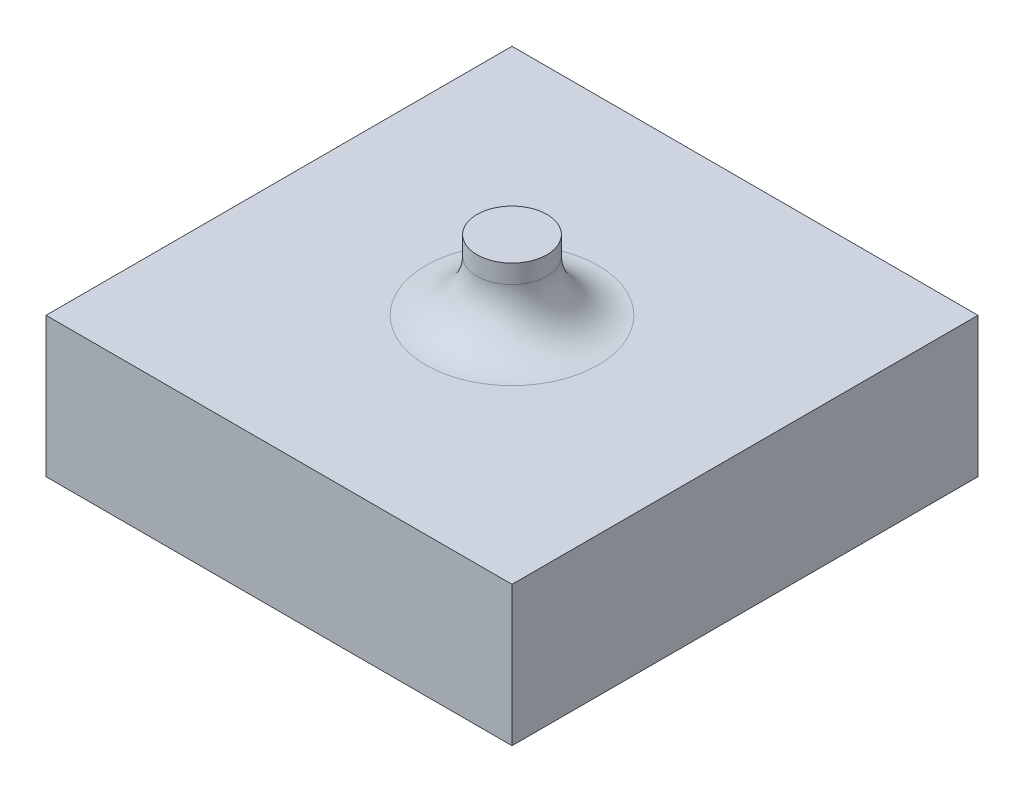
ISO-10303-21;
HEADER;
FILE_DESCRIPTION(('STEP AP214'),'2;1');
FILE_NAME('part.step','',(''),(''),'','','');
FILE_SCHEMA(('AUTOMOTIVE_DESIGN { 1 0 10303 214 1 1 1 1 }'));
ENDSEC;
DATA;
#1=APPLICATION_CONTEXT('core data for automotive mechanical design processes');
#2=APPLICATION_PROTOCOL_DEFINITION('international standard','automotive_design',2000,#1);
#3=PRODUCT_CONTEXT('',#1,'mechanical');
#4=PRODUCT('Part','Part','',(#3));
#5=PRODUCT_RELATED_PRODUCT_CATEGORY('part','',(#4));
#6=PRODUCT_DEFINITION_FORMATION('','',#4);
#7=PRODUCT_DEFINITION_CONTEXT('part definition',#1,'design');
#8=PRODUCT_DEFINITION('design','',#6,#7);
#9=PRODUCT_DEFINITION_SHAPE('','',#8);
#10=(LENGTH_UNIT() NAMED_UNIT(*) SI_UNIT(.MILLI.,.METRE.));
#11=(NAMED_UNIT(*) PLANE_ANGLE_UNIT() SI_UNIT($,.RADIAN.));
#12=(NAMED_UNIT(*) SI_UNIT($,.STERADIAN.) SOLID_ANGLE_UNIT());
#13=UNCERTAINTY_MEASURE_WITH_UNIT(LENGTH_MEASURE(1.E-05),#10,'distance_accuracy_value','');
#14=(GEOMETRIC_REPRESENTATION_CONTEXT(3) GLOBAL_UNCERTAINTY_ASSIGNED_CONTEXT((#13)) GLOBAL_UNIT_ASSIGNED_CONTEXT((#10,
#11,#12)) REPRESENTATION_CONTEXT('',''));
#15=CARTESIAN_POINT('',(0.,0.,0.));
#16=DIRECTION('',(0.,0.,1.));
#17=DIRECTION('',(1.,0.,0.));
#18=AXIS2_PLACEMENT_3D('',#15,#16,#17);
#19=CARTESIAN_POINT('',(-5.,3.,-5.));
#20=DIRECTION('',(1.,0.,0.));
#21=DIRECTION('',(0.,0.,-1.));
#22=AXIS2_PLACEMENT_3D('',#19,#20,#21);
#23=PLANE('',#22);
#24=DIRECTION('',(0.,0.,1.));
#25=VECTOR('',#24,1.);
#26=CARTESIAN_POINT('',(-5.,0.,-5.));
#27=LINE('',#26,#25);
#28=CARTESIAN_POINT('',(-5.,0.,-5.));
#29=VERTEX_POINT('',#28);
#30=CARTESIAN_POINT('',(-5.,0.,5.));
#31=VERTEX_POINT('',#30);
#32=EDGE_CURVE('E106',#29,#31,#27,.T.);
#33=ORIENTED_EDGE('',*,*,#32,.T.);
#34=DIRECTION('',(0.,-1.,0.));
#35=VECTOR('',#34,1.);
#36=CARTESIAN_POINT('',(-5.,3.,5.));
#37=LINE('',#36,#35);
#38=CARTESIAN_POINT('',(-5.,3.,5.));
#39=VERTEX_POINT('',#38);
#40=EDGE_CURVE('E97',#39,#31,#37,.T.);
#41=ORIENTED_EDGE('',*,*,#40,.F.);
#42=DIRECTION('',(0.,0.,1.));
#43=VECTOR('',#42,1.);
#44=CARTESIAN_POINT('',(-5.,3.,-5.));
#45=LINE('',#44,#43);
#46=CARTESIAN_POINT('',(-5.,3.,-5.));
#47=VERTEX_POINT('',#46);
#48=EDGE_CURVE('E91',#47,#39,#45,.T.);
#49=ORIENTED_EDGE('',*,*,#48,.F.);
#50=DIRECTION('',(0.,-1.,0.));
#51=VECTOR('',#50,1.);
#52=CARTESIAN_POINT('',(-5.,3.,-5.));
#53=LINE('',#52,#51);
#54=EDGE_CURVE('E102',#47,#29,#53,.T.);
#55=ORIENTED_EDGE('',*,*,#54,.T.);
#56=EDGE_LOOP('',(#33,#41,#49,#55));
#57=FACE_BOUND('',#56,.T.);
#58=ADVANCED_FACE('F38',(#57),#23,.F.);
#59=CARTESIAN_POINT('',(5.,3.,5.));
#60=DIRECTION('',(0.,0.,-1.));
#61=DIRECTION('',(-1.,0.,0.));
#62=AXIS2_PLACEMENT_3D('',#59,#60,#61);
#63=PLANE('',#62);
#64=DIRECTION('',(1.,0.,0.));
#65=VECTOR('',#64,1.);
#66=CARTESIAN_POINT('',(5.,0.,5.));
#67=LINE('',#66,#65);
#68=CARTESIAN_POINT('',(5.,0.,5.));
#69=VERTEX_POINT('',#68);
#70=EDGE_CURVE('E96',#31,#69,#67,.T.);
#71=ORIENTED_EDGE('',*,*,#70,.T.);
#72=DIRECTION('',(0.,-1.,0.));
#73=VECTOR('',#72,1.);
#74=CARTESIAN_POINT('',(5.,3.,5.));
#75=LINE('',#74,#73);
#76=CARTESIAN_POINT('',(5.,3.,5.));
#77=VERTEX_POINT('',#76);
#78=EDGE_CURVE('E94',#77,#69,#75,.T.);
#79=ORIENTED_EDGE('',*,*,#78,.F.);
#80=DIRECTION('',(1.,0.,0.));
#81=VECTOR('',#80,1.);
#82=CARTESIAN_POINT('',(5.,3.,5.));
#83=LINE('',#82,#81);
#84=EDGE_CURVE('E86',#39,#77,#83,.T.);
#85=ORIENTED_EDGE('',*,*,#84,.F.);
#86=ORIENTED_EDGE('',*,*,#40,.T.);
#87=EDGE_LOOP('',(#71,#79,#85,#86));
#88=FACE_BOUND('',#87,.T.);
#89=ADVANCED_FACE('F95',(#88),#63,.F.);
#90=CARTESIAN_POINT('',(5.,3.,-5.));
#91=DIRECTION('',(-1.,0.,0.));
#92=DIRECTION('',(0.,0.,1.));
#93=AXIS2_PLACEMENT_3D('',#90,#91,#92);
#94=PLANE('',#93);
#95=DIRECTION('',(0.,0.,-1.));
#96=VECTOR('',#95,1.);
#97=CARTESIAN_POINT('',(5.,0.,-5.));
#98=LINE('',#97,#96);
#99=CARTESIAN_POINT('',(5.,0.,-5.));
#100=VERTEX_POINT('',#99);
#101=EDGE_CURVE('E72',#69,#100,#98,.T.);
#102=ORIENTED_EDGE('',*,*,#101,.T.);
#103=DIRECTION('',(0.,-1.,0.));
#104=VECTOR('',#103,1.);
#105=CARTESIAN_POINT('',(5.,3.,-5.));
#106=LINE('',#105,#104);
#107=CARTESIAN_POINT('',(5.,3.,-5.));
#108=VERTEX_POINT('',#107);
#109=EDGE_CURVE('E98',#108,#100,#106,.T.);
#110=ORIENTED_EDGE('',*,*,#109,.F.);
#111=DIRECTION('',(0.,0.,-1.));
#112=VECTOR('',#111,1.);
#113=CARTESIAN_POINT('',(5.,3.,-5.));
#114=LINE('',#113,#112);
#115=EDGE_CURVE('E89',#77,#108,#114,.T.);
#116=ORIENTED_EDGE('',*,*,#115,.F.);
#117=ORIENTED_EDGE('',*,*,#78,.T.);
#118=EDGE_LOOP('',(#102,#110,#116,#117));
#119=FACE_BOUND('',#118,.T.);
#120=ADVANCED_FACE('F100',(#119),#94,.F.);
#121=CARTESIAN_POINT('',(5.,3.,-5.));
#122=DIRECTION('',(0.,0.,1.));
#123=DIRECTION('',(1.,0.,0.));
#124=AXIS2_PLACEMENT_3D('',#121,#122,#123);
#125=PLANE('',#124);
#126=DIRECTION('',(-1.,0.,0.));
#127=VECTOR('',#126,1.);
#128=CARTESIAN_POINT('',(5.,0.,-5.));
#129=LINE('',#128,#127);
#130=EDGE_CURVE('E78',#100,#29,#129,.T.);
#131=ORIENTED_EDGE('',*,*,#130,.T.);
#132=ORIENTED_EDGE('',*,*,#54,.F.);
#133=DIRECTION('',(-1.,0.,0.));
#134=VECTOR('',#133,1.);
#135=CARTESIAN_POINT('',(5.,3.,-5.));
#136=LINE('',#135,#134);
#137=EDGE_CURVE('E55',#108,#47,#136,.T.);
#138=ORIENTED_EDGE('',*,*,#137,.F.);
#139=ORIENTED_EDGE('',*,*,#109,.T.);
#140=EDGE_LOOP('',(#131,#132,#138,#139));
#141=FACE_BOUND('',#140,.T.);
#142=ADVANCED_FACE('F139',(#141),#125,.F.);
#143=CARTESIAN_POINT('',(0.,3.,0.));
#144=DIRECTION('',(0.,-1.,0.));
#145=DIRECTION('',(0.,0.,-1.));
#146=AXIS2_PLACEMENT_3D('',#143,#144,#145);
#147=PLANE('',#146);
#148=CARTESIAN_POINT('',(0.,3.,0.));
#149=DIRECTION('',(0.,-1.,0.));
#150=DIRECTION('',(0.,0.,-1.));
#151=AXIS2_PLACEMENT_3D('',#148,#149,#150);
#152=CIRCLE('',#151,1.85);
#153=CARTESIAN_POINT('',(0.,3.,-1.85));
#154=VERTEX_POINT('',#153);
#155=EDGE_CURVE('E12',#154,#154,#152,.T.);
#156=ORIENTED_EDGE('',*,*,#155,.T.);
#157=EDGE_LOOP('',(#156));
#158=FACE_BOUND('',#157,.T.);
#159=ORIENTED_EDGE('',*,*,#48,.T.);
#160=ORIENTED_EDGE('',*,*,#84,.T.);
#161=ORIENTED_EDGE('',*,*,#115,.T.);
#162=ORIENTED_EDGE('',*,*,#137,.T.);
#163=EDGE_LOOP('',(#159,#160,#161,#162));
#164=FACE_BOUND('',#163,.T.);
#165=ADVANCED_FACE('F87',(#158,#164),#147,.F.);
#166=CARTESIAN_POINT('',(0.,0.,0.));
#167=DIRECTION('',(0.,-1.,0.));
#168=DIRECTION('',(0.,0.,-1.));
#169=AXIS2_PLACEMENT_3D('',#166,#167,#168);
#170=PLANE('',#169);
#171=ORIENTED_EDGE('',*,*,#32,.F.);
#172=ORIENTED_EDGE('',*,*,#130,.F.);
#173=ORIENTED_EDGE('',*,*,#101,.F.);
#174=ORIENTED_EDGE('',*,*,#70,.F.);
#175=EDGE_LOOP('',(#171,#172,#173,#174));
#176=FACE_BOUND('',#175,.T.);
#177=ADVANCED_FACE('F142',(#176),#170,.T.);
#178=CARTESIAN_POINT('',(0.,4.5,0.));
#179=DIRECTION('',(0.,-1.,0.));
#180=DIRECTION('',(0.,0.,-1.));
#181=AXIS2_PLACEMENT_3D('',#178,#179,#180);
#182=CYLINDRICAL_SURFACE('',#181,0.75);
#183=CARTESIAN_POINT('',(0.,4.1,0.));
#184=DIRECTION('',(0.,-1.,0.));
#185=DIRECTION('',(0.,0.,-1.));
#186=AXIS2_PLACEMENT_3D('',#183,#184,#185);
#187=CIRCLE('',#186,0.75);
#188=CARTESIAN_POINT('',(0.,4.1,-0.75));
#189=VERTEX_POINT('',#188);
#190=EDGE_CURVE('E47',#189,#189,#187,.F.);
#191=ORIENTED_EDGE('',*,*,#190,.T.);
#192=EDGE_LOOP('',(#191));
#193=FACE_BOUND('',#192,.T.);
#194=CARTESIAN_POINT('',(0.,4.5,0.));
#195=DIRECTION('',(0.,1.,0.));
#196=DIRECTION('',(0.,0.,1.));
#197=AXIS2_PLACEMENT_3D('',#194,#195,#196);
#198=CIRCLE('',#197,0.75);
#199=CARTESIAN_POINT('',(0.,4.5,0.75));
#200=VERTEX_POINT('',#199);
#201=EDGE_CURVE('E109',#200,#200,#198,.T.);
#202=ORIENTED_EDGE('',*,*,#201,.F.);
#203=EDGE_LOOP('',(#202));
#204=FACE_BOUND('',#203,.T.);
#205=ADVANCED_FACE('F118',(#193,#204),#182,.T.);
#206=CARTESIAN_POINT('',(0.,4.5,0.));
#207=DIRECTION('',(0.,1.,0.));
#208=DIRECTION('',(0.,0.,1.));
#209=AXIS2_PLACEMENT_3D('',#206,#207,#208);
#210=PLANE('',#209);
#211=ORIENTED_EDGE('',*,*,#201,.T.);
#212=EDGE_LOOP('',(#211));
#213=FACE_BOUND('',#212,.T.);
#214=ADVANCED_FACE('F122',(#213),#210,.T.);
#215=CARTESIAN_POINT('',(0.,4.1,0.));
#216=DIRECTION('',(0.,-1.,0.));
#217=DIRECTION('',(0.,0.,-1.));
#218=AXIS2_PLACEMENT_3D('',#215,#216,#217);
#219=TOROIDAL_SURFACE('',#218,1.85,1.1);
#220=ORIENTED_EDGE('',*,*,#155,.F.);
#221=EDGE_LOOP('',(#220));
#222=FACE_BOUND('',#221,.T.);
#223=ORIENTED_EDGE('',*,*,#190,.F.);
#224=EDGE_LOOP('',(#223));
#225=FACE_BOUND('',#224,.T.);
#226=ADVANCED_FACE('F40',(#222,#225),#219,.F.);
#227=CLOSED_SHELL('',(#58,#89,#120,#142,#165,#177,#205,#214,#226));
#228=MANIFOLD_SOLID_BREP('B2',#227);
#229=ADVANCED_BREP_SHAPE_REPRESENTATION('',(#18,#228),#14);
#230=SHAPE_DEFINITION_REPRESENTATION(#9,#229);
ENDSEC;
END-ISO-10303-21;
